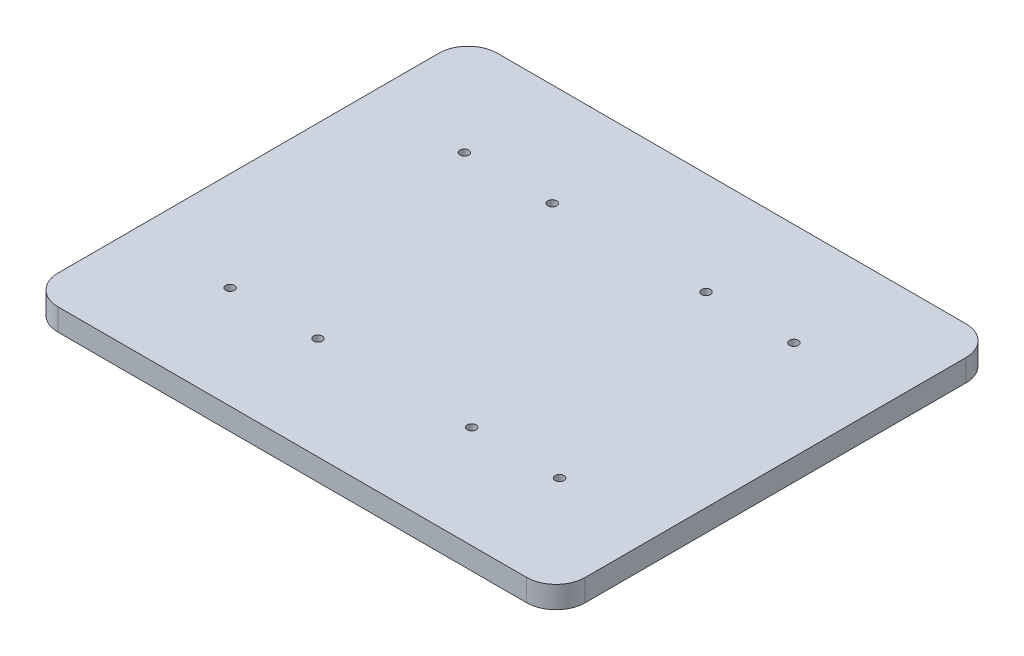
ISO-10303-21;
HEADER;
FILE_DESCRIPTION(('STEP AP214'),'2;1');
FILE_NAME('part.step','',(''),(''),'','','');
FILE_SCHEMA(('AUTOMOTIVE_DESIGN { 1 0 10303 214 1 1 1 1 }'));
ENDSEC;
DATA;
#1=APPLICATION_CONTEXT('core data for automotive mechanical design processes');
#2=APPLICATION_PROTOCOL_DEFINITION('international standard','automotive_design',2000,#1);
#3=PRODUCT_CONTEXT('',#1,'mechanical');
#4=PRODUCT('Part','Part','',(#3));
#5=PRODUCT_RELATED_PRODUCT_CATEGORY('part','',(#4));
#6=PRODUCT_DEFINITION_FORMATION('','',#4);
#7=PRODUCT_DEFINITION_CONTEXT('part definition',#1,'design');
#8=PRODUCT_DEFINITION('design','',#6,#7);
#9=PRODUCT_DEFINITION_SHAPE('','',#8);
#10=(LENGTH_UNIT() NAMED_UNIT(*) SI_UNIT(.MILLI.,.METRE.));
#11=(NAMED_UNIT(*) PLANE_ANGLE_UNIT() SI_UNIT($,.RADIAN.));
#12=(NAMED_UNIT(*) SI_UNIT($,.STERADIAN.) SOLID_ANGLE_UNIT());
#13=UNCERTAINTY_MEASURE_WITH_UNIT(LENGTH_MEASURE(1.E-05),#10,'distance_accuracy_value','');
#14=(GEOMETRIC_REPRESENTATION_CONTEXT(3) GLOBAL_UNCERTAINTY_ASSIGNED_CONTEXT((#13)) GLOBAL_UNIT_ASSIGNED_CONTEXT((#10,
#11,#12)) REPRESENTATION_CONTEXT('',''));
#15=CARTESIAN_POINT('',(0.,0.,0.));
#16=DIRECTION('',(0.,0.,1.));
#17=DIRECTION('',(1.,0.,0.));
#18=AXIS2_PLACEMENT_3D('',#15,#16,#17);
#19=CARTESIAN_POINT('',(0.,15.,0.));
#20=DIRECTION('',(0.,-1.,0.));
#21=DIRECTION('',(0.,0.,-1.));
#22=AXIS2_PLACEMENT_3D('',#19,#20,#21);
#23=PLANE('',#22);
#24=CARTESIAN_POINT('',(112.5,15.,80.));
#25=DIRECTION('',(0.,1.,0.));
#26=DIRECTION('',(0.,0.,1.));
#27=AXIS2_PLACEMENT_3D('',#24,#25,#26);
#28=CIRCLE('',#27,3.);
#29=CARTESIAN_POINT('',(112.5,15.,83.));
#30=VERTEX_POINT('',#29);
#31=EDGE_CURVE('E208',#30,#30,#28,.T.);
#32=ORIENTED_EDGE('',*,*,#31,.F.);
#33=EDGE_LOOP('',(#32));
#34=FACE_BOUND('',#33,.T.);
#35=CARTESIAN_POINT('',(112.5,15.,-80.));
#36=DIRECTION('',(0.,1.,0.));
#37=DIRECTION('',(0.,0.,1.));
#38=AXIS2_PLACEMENT_3D('',#35,#36,#37);
#39=CIRCLE('',#38,3.);
#40=CARTESIAN_POINT('',(112.5,15.,-77.));
#41=VERTEX_POINT('',#40);
#42=EDGE_CURVE('E202',#41,#41,#39,.T.);
#43=ORIENTED_EDGE('',*,*,#42,.F.);
#44=EDGE_LOOP('',(#43));
#45=FACE_BOUND('',#44,.T.);
#46=CARTESIAN_POINT('',(52.5,15.,-80.));
#47=DIRECTION('',(0.,1.,0.));
#48=DIRECTION('',(0.,0.,1.));
#49=AXIS2_PLACEMENT_3D('',#46,#47,#48);
#50=CIRCLE('',#49,3.);
#51=CARTESIAN_POINT('',(52.5,15.,-77.));
#52=VERTEX_POINT('',#51);
#53=EDGE_CURVE('E196',#52,#52,#50,.T.);
#54=ORIENTED_EDGE('',*,*,#53,.F.);
#55=EDGE_LOOP('',(#54));
#56=FACE_BOUND('',#55,.T.);
#57=CARTESIAN_POINT('',(-52.5,15.,-80.));
#58=DIRECTION('',(0.,1.,0.));
#59=DIRECTION('',(0.,0.,1.));
#60=AXIS2_PLACEMENT_3D('',#57,#58,#59);
#61=CIRCLE('',#60,3.);
#62=CARTESIAN_POINT('',(-52.5,15.,-77.));
#63=VERTEX_POINT('',#62);
#64=EDGE_CURVE('E190',#63,#63,#61,.T.);
#65=ORIENTED_EDGE('',*,*,#64,.F.);
#66=EDGE_LOOP('',(#65));
#67=FACE_BOUND('',#66,.T.);
#68=DIRECTION('',(-1.,0.,0.));
#69=VECTOR('',#68,1.);
#70=CARTESIAN_POINT('',(-180.,15.,-150.));
#71=LINE('',#70,#69);
#72=CARTESIAN_POINT('',(160.,15.,-150.));
#73=VERTEX_POINT('',#72);
#74=CARTESIAN_POINT('',(-160.,15.,-150.));
#75=VERTEX_POINT('',#74);
#76=EDGE_CURVE('E171',#73,#75,#71,.T.);
#77=ORIENTED_EDGE('',*,*,#76,.T.);
#78=CARTESIAN_POINT('',(-160.,15.,-130.));
#79=DIRECTION('',(0.,-1.,0.));
#80=DIRECTION('',(0.,0.,-1.));
#81=AXIS2_PLACEMENT_3D('',#78,#79,#80);
#82=CIRCLE('',#81,20.);
#83=CARTESIAN_POINT('',(-180.,15.,-130.));
#84=VERTEX_POINT('',#83);
#85=EDGE_CURVE('E151',#75,#84,#82,.F.);
#86=ORIENTED_EDGE('',*,*,#85,.T.);
#87=DIRECTION('',(0.,0.,1.));
#88=VECTOR('',#87,1.);
#89=CARTESIAN_POINT('',(-180.,15.,150.));
#90=LINE('',#89,#88);
#91=CARTESIAN_POINT('',(-180.,15.,130.));
#92=VERTEX_POINT('',#91);
#93=EDGE_CURVE('E122',#84,#92,#90,.T.);
#94=ORIENTED_EDGE('',*,*,#93,.T.);
#95=CARTESIAN_POINT('',(-160.,15.,130.));
#96=DIRECTION('',(0.,-1.,0.));
#97=DIRECTION('',(0.,0.,-1.));
#98=AXIS2_PLACEMENT_3D('',#95,#96,#97);
#99=CIRCLE('',#98,20.);
#100=CARTESIAN_POINT('',(-160.,15.,150.));
#101=VERTEX_POINT('',#100);
#102=EDGE_CURVE('E58',#92,#101,#99,.F.);
#103=ORIENTED_EDGE('',*,*,#102,.T.);
#104=DIRECTION('',(1.,0.,0.));
#105=VECTOR('',#104,1.);
#106=CARTESIAN_POINT('',(-180.,15.,150.));
#107=LINE('',#106,#105);
#108=CARTESIAN_POINT('',(160.,15.,150.));
#109=VERTEX_POINT('',#108);
#110=EDGE_CURVE('E138',#101,#109,#107,.T.);
#111=ORIENTED_EDGE('',*,*,#110,.T.);
#112=CARTESIAN_POINT('',(160.,15.,130.));
#113=DIRECTION('',(0.,-1.,0.));
#114=DIRECTION('',(0.,0.,-1.));
#115=AXIS2_PLACEMENT_3D('',#112,#113,#114);
#116=CIRCLE('',#115,20.);
#117=CARTESIAN_POINT('',(180.,15.,130.));
#118=VERTEX_POINT('',#117);
#119=EDGE_CURVE('E146',#109,#118,#116,.F.);
#120=ORIENTED_EDGE('',*,*,#119,.T.);
#121=DIRECTION('',(0.,0.,-1.));
#122=VECTOR('',#121,1.);
#123=CARTESIAN_POINT('',(180.,15.,150.));
#124=LINE('',#123,#122);
#125=CARTESIAN_POINT('',(180.,15.,-130.));
#126=VERTEX_POINT('',#125);
#127=EDGE_CURVE('E132',#118,#126,#124,.T.);
#128=ORIENTED_EDGE('',*,*,#127,.T.);
#129=CARTESIAN_POINT('',(160.,15.,-130.));
#130=DIRECTION('',(0.,-1.,0.));
#131=DIRECTION('',(0.,0.,-1.));
#132=AXIS2_PLACEMENT_3D('',#129,#130,#131);
#133=CIRCLE('',#132,20.);
#134=EDGE_CURVE('E149',#126,#73,#133,.F.);
#135=ORIENTED_EDGE('',*,*,#134,.T.);
#136=EDGE_LOOP('',(#77,#86,#94,#103,#111,#120,#128,#135));
#137=FACE_BOUND('',#136,.T.);
#138=CARTESIAN_POINT('',(-112.5,15.,-80.));
#139=DIRECTION('',(0.,1.,0.));
#140=DIRECTION('',(0.,0.,1.));
#141=AXIS2_PLACEMENT_3D('',#138,#139,#140);
#142=CIRCLE('',#141,3.);
#143=CARTESIAN_POINT('',(-112.5,15.,-77.));
#144=VERTEX_POINT('',#143);
#145=EDGE_CURVE('E179',#144,#144,#142,.T.);
#146=ORIENTED_EDGE('',*,*,#145,.F.);
#147=EDGE_LOOP('',(#146));
#148=FACE_BOUND('',#147,.T.);
#149=CARTESIAN_POINT('',(52.5,15.,80.));
#150=DIRECTION('',(0.,1.,0.));
#151=DIRECTION('',(0.,0.,1.));
#152=AXIS2_PLACEMENT_3D('',#149,#150,#151);
#153=CIRCLE('',#152,3.);
#154=CARTESIAN_POINT('',(52.5,15.,83.));
#155=VERTEX_POINT('',#154);
#156=EDGE_CURVE('E214',#155,#155,#153,.T.);
#157=ORIENTED_EDGE('',*,*,#156,.F.);
#158=EDGE_LOOP('',(#157));
#159=FACE_BOUND('',#158,.T.);
#160=CARTESIAN_POINT('',(-52.5,15.,80.));
#161=DIRECTION('',(0.,1.,0.));
#162=DIRECTION('',(0.,0.,1.));
#163=AXIS2_PLACEMENT_3D('',#160,#161,#162);
#164=CIRCLE('',#163,3.);
#165=CARTESIAN_POINT('',(-52.5,15.,83.));
#166=VERTEX_POINT('',#165);
#167=EDGE_CURVE('E220',#166,#166,#164,.T.);
#168=ORIENTED_EDGE('',*,*,#167,.F.);
#169=EDGE_LOOP('',(#168));
#170=FACE_BOUND('',#169,.T.);
#171=CARTESIAN_POINT('',(-112.5,15.,80.));
#172=DIRECTION('',(0.,1.,0.));
#173=DIRECTION('',(0.,0.,1.));
#174=AXIS2_PLACEMENT_3D('',#171,#172,#173);
#175=CIRCLE('',#174,3.);
#176=CARTESIAN_POINT('',(-112.5,15.,83.));
#177=VERTEX_POINT('',#176);
#178=EDGE_CURVE('E226',#177,#177,#175,.T.);
#179=ORIENTED_EDGE('',*,*,#178,.F.);
#180=EDGE_LOOP('',(#179));
#181=FACE_BOUND('',#180,.T.);
#182=ADVANCED_FACE('F37',(#34,#45,#56,#67,#137,#148,#159,#170,#181),#23,.F.);
#183=CARTESIAN_POINT('',(180.,15.,150.));
#184=DIRECTION('',(-1.,0.,0.));
#185=DIRECTION('',(0.,0.,1.));
#186=AXIS2_PLACEMENT_3D('',#183,#184,#185);
#187=PLANE('',#186);
#188=DIRECTION('',(0.,0.,-1.));
#189=VECTOR('',#188,1.);
#190=CARTESIAN_POINT('',(180.,0.,150.));
#191=LINE('',#190,#189);
#192=CARTESIAN_POINT('',(180.,0.,130.));
#193=VERTEX_POINT('',#192);
#194=CARTESIAN_POINT('',(180.,0.,-130.));
#195=VERTEX_POINT('',#194);
#196=EDGE_CURVE('E134',#193,#195,#191,.T.);
#197=ORIENTED_EDGE('',*,*,#196,.T.);
#198=DIRECTION('',(0.,-1.,0.));
#199=VECTOR('',#198,1.);
#200=CARTESIAN_POINT('',(180.,15.,-130.));
#201=LINE('',#200,#199);
#202=EDGE_CURVE('E156',#195,#126,#201,.F.);
#203=ORIENTED_EDGE('',*,*,#202,.T.);
#204=ORIENTED_EDGE('',*,*,#127,.F.);
#205=DIRECTION('',(0.,-1.,0.));
#206=VECTOR('',#205,1.);
#207=CARTESIAN_POINT('',(180.,15.,130.));
#208=LINE('',#207,#206);
#209=EDGE_CURVE('E153',#118,#193,#208,.T.);
#210=ORIENTED_EDGE('',*,*,#209,.T.);
#211=EDGE_LOOP('',(#197,#203,#204,#210));
#212=FACE_BOUND('',#211,.T.);
#213=ADVANCED_FACE('F162',(#212),#187,.F.);
#214=CARTESIAN_POINT('',(-180.,15.,-150.));
#215=DIRECTION('',(0.,0.,1.));
#216=DIRECTION('',(1.,0.,0.));
#217=AXIS2_PLACEMENT_3D('',#214,#215,#216);
#218=PLANE('',#217);
#219=DIRECTION('',(-1.,0.,0.));
#220=VECTOR('',#219,1.);
#221=CARTESIAN_POINT('',(-180.,0.,-150.));
#222=LINE('',#221,#220);
#223=CARTESIAN_POINT('',(160.,0.,-150.));
#224=VERTEX_POINT('',#223);
#225=CARTESIAN_POINT('',(-160.,0.,-150.));
#226=VERTEX_POINT('',#225);
#227=EDGE_CURVE('E130',#224,#226,#222,.T.);
#228=ORIENTED_EDGE('',*,*,#227,.T.);
#229=DIRECTION('',(0.,-1.,0.));
#230=VECTOR('',#229,1.);
#231=CARTESIAN_POINT('',(-160.,15.,-150.));
#232=LINE('',#231,#230);
#233=EDGE_CURVE('E108',#226,#75,#232,.F.);
#234=ORIENTED_EDGE('',*,*,#233,.T.);
#235=ORIENTED_EDGE('',*,*,#76,.F.);
#236=DIRECTION('',(0.,-1.,0.));
#237=VECTOR('',#236,1.);
#238=CARTESIAN_POINT('',(160.,15.,-150.));
#239=LINE('',#238,#237);
#240=EDGE_CURVE('E113',#73,#224,#239,.T.);
#241=ORIENTED_EDGE('',*,*,#240,.T.);
#242=EDGE_LOOP('',(#228,#234,#235,#241));
#243=FACE_BOUND('',#242,.T.);
#244=ADVANCED_FACE('F176',(#243),#218,.F.);
#245=CARTESIAN_POINT('',(-180.,15.,150.));
#246=DIRECTION('',(1.,0.,0.));
#247=DIRECTION('',(0.,0.,-1.));
#248=AXIS2_PLACEMENT_3D('',#245,#246,#247);
#249=PLANE('',#248);
#250=ORIENTED_EDGE('',*,*,#93,.F.);
#251=DIRECTION('',(0.,-1.,0.));
#252=VECTOR('',#251,1.);
#253=CARTESIAN_POINT('',(-180.,15.,-130.));
#254=LINE('',#253,#252);
#255=CARTESIAN_POINT('',(-180.,0.,-130.));
#256=VERTEX_POINT('',#255);
#257=EDGE_CURVE('E107',#84,#256,#254,.T.);
#258=ORIENTED_EDGE('',*,*,#257,.T.);
#259=DIRECTION('',(0.,0.,1.));
#260=VECTOR('',#259,1.);
#261=CARTESIAN_POINT('',(-180.,0.,150.));
#262=LINE('',#261,#260);
#263=CARTESIAN_POINT('',(-180.,0.,130.));
#264=VERTEX_POINT('',#263);
#265=EDGE_CURVE('E120',#256,#264,#262,.T.);
#266=ORIENTED_EDGE('',*,*,#265,.T.);
#267=DIRECTION('',(0.,-1.,0.));
#268=VECTOR('',#267,1.);
#269=CARTESIAN_POINT('',(-180.,15.,130.));
#270=LINE('',#269,#268);
#271=EDGE_CURVE('E124',#264,#92,#270,.F.);
#272=ORIENTED_EDGE('',*,*,#271,.T.);
#273=EDGE_LOOP('',(#250,#258,#266,#272));
#274=FACE_BOUND('',#273,.T.);
#275=ADVANCED_FACE('F119',(#274),#249,.F.);
#276=CARTESIAN_POINT('',(-180.,15.,150.));
#277=DIRECTION('',(0.,0.,-1.));
#278=DIRECTION('',(-1.,0.,0.));
#279=AXIS2_PLACEMENT_3D('',#276,#277,#278);
#280=PLANE('',#279);
#281=ORIENTED_EDGE('',*,*,#110,.F.);
#282=DIRECTION('',(0.,-1.,0.));
#283=VECTOR('',#282,1.);
#284=CARTESIAN_POINT('',(-160.,15.,150.));
#285=LINE('',#284,#283);
#286=CARTESIAN_POINT('',(-160.,0.,150.));
#287=VERTEX_POINT('',#286);
#288=EDGE_CURVE('E11',#101,#287,#285,.T.);
#289=ORIENTED_EDGE('',*,*,#288,.T.);
#290=DIRECTION('',(1.,0.,0.));
#291=VECTOR('',#290,1.);
#292=CARTESIAN_POINT('',(-180.,0.,150.));
#293=LINE('',#292,#291);
#294=CARTESIAN_POINT('',(160.,0.,150.));
#295=VERTEX_POINT('',#294);
#296=EDGE_CURVE('E129',#287,#295,#293,.T.);
#297=ORIENTED_EDGE('',*,*,#296,.T.);
#298=DIRECTION('',(0.,-1.,0.));
#299=VECTOR('',#298,1.);
#300=CARTESIAN_POINT('',(160.,15.,150.));
#301=LINE('',#300,#299);
#302=EDGE_CURVE('E45',#295,#109,#301,.F.);
#303=ORIENTED_EDGE('',*,*,#302,.T.);
#304=EDGE_LOOP('',(#281,#289,#297,#303));
#305=FACE_BOUND('',#304,.T.);
#306=ADVANCED_FACE('F248',(#305),#280,.F.);
#307=CARTESIAN_POINT('',(0.,0.,0.));
#308=DIRECTION('',(0.,-1.,0.));
#309=DIRECTION('',(0.,0.,-1.));
#310=AXIS2_PLACEMENT_3D('',#307,#308,#309);
#311=PLANE('',#310);
#312=CARTESIAN_POINT('',(-112.5,0.,80.));
#313=DIRECTION('',(0.,-1.,0.));
#314=DIRECTION('',(0.,0.,-1.));
#315=AXIS2_PLACEMENT_3D('',#312,#313,#314);
#316=CIRCLE('',#315,3.);
#317=CARTESIAN_POINT('',(-112.5,0.,77.));
#318=VERTEX_POINT('',#317);
#319=EDGE_CURVE('E223',#318,#318,#316,.T.);
#320=ORIENTED_EDGE('',*,*,#319,.F.);
#321=EDGE_LOOP('',(#320));
#322=FACE_BOUND('',#321,.T.);
#323=CARTESIAN_POINT('',(-52.5,0.,80.));
#324=DIRECTION('',(0.,-1.,0.));
#325=DIRECTION('',(0.,0.,-1.));
#326=AXIS2_PLACEMENT_3D('',#323,#324,#325);
#327=CIRCLE('',#326,3.);
#328=CARTESIAN_POINT('',(-52.5,0.,77.));
#329=VERTEX_POINT('',#328);
#330=EDGE_CURVE('E217',#329,#329,#327,.T.);
#331=ORIENTED_EDGE('',*,*,#330,.F.);
#332=EDGE_LOOP('',(#331));
#333=FACE_BOUND('',#332,.T.);
#334=CARTESIAN_POINT('',(52.5,0.,80.));
#335=DIRECTION('',(0.,-1.,0.));
#336=DIRECTION('',(0.,0.,-1.));
#337=AXIS2_PLACEMENT_3D('',#334,#335,#336);
#338=CIRCLE('',#337,3.);
#339=CARTESIAN_POINT('',(52.5,0.,77.));
#340=VERTEX_POINT('',#339);
#341=EDGE_CURVE('E211',#340,#340,#338,.T.);
#342=ORIENTED_EDGE('',*,*,#341,.F.);
#343=EDGE_LOOP('',(#342));
#344=FACE_BOUND('',#343,.T.);
#345=CARTESIAN_POINT('',(112.5,0.,80.));
#346=DIRECTION('',(0.,-1.,0.));
#347=DIRECTION('',(0.,0.,-1.));
#348=AXIS2_PLACEMENT_3D('',#345,#346,#347);
#349=CIRCLE('',#348,3.);
#350=CARTESIAN_POINT('',(112.5,0.,77.));
#351=VERTEX_POINT('',#350);
#352=EDGE_CURVE('E205',#351,#351,#349,.T.);
#353=ORIENTED_EDGE('',*,*,#352,.F.);
#354=EDGE_LOOP('',(#353));
#355=FACE_BOUND('',#354,.T.);
#356=CARTESIAN_POINT('',(112.5,0.,-80.));
#357=DIRECTION('',(0.,-1.,0.));
#358=DIRECTION('',(0.,0.,-1.));
#359=AXIS2_PLACEMENT_3D('',#356,#357,#358);
#360=CIRCLE('',#359,3.);
#361=CARTESIAN_POINT('',(112.5,0.,-83.));
#362=VERTEX_POINT('',#361);
#363=EDGE_CURVE('E199',#362,#362,#360,.T.);
#364=ORIENTED_EDGE('',*,*,#363,.F.);
#365=EDGE_LOOP('',(#364));
#366=FACE_BOUND('',#365,.T.);
#367=CARTESIAN_POINT('',(52.5,0.,-80.));
#368=DIRECTION('',(0.,-1.,0.));
#369=DIRECTION('',(0.,0.,-1.));
#370=AXIS2_PLACEMENT_3D('',#367,#368,#369);
#371=CIRCLE('',#370,3.);
#372=CARTESIAN_POINT('',(52.5,0.,-83.));
#373=VERTEX_POINT('',#372);
#374=EDGE_CURVE('E193',#373,#373,#371,.T.);
#375=ORIENTED_EDGE('',*,*,#374,.F.);
#376=EDGE_LOOP('',(#375));
#377=FACE_BOUND('',#376,.T.);
#378=CARTESIAN_POINT('',(-52.5,0.,-80.));
#379=DIRECTION('',(0.,-1.,0.));
#380=DIRECTION('',(0.,0.,-1.));
#381=AXIS2_PLACEMENT_3D('',#378,#379,#380);
#382=CIRCLE('',#381,3.);
#383=CARTESIAN_POINT('',(-52.5,0.,-83.));
#384=VERTEX_POINT('',#383);
#385=EDGE_CURVE('E187',#384,#384,#382,.T.);
#386=ORIENTED_EDGE('',*,*,#385,.F.);
#387=EDGE_LOOP('',(#386));
#388=FACE_BOUND('',#387,.T.);
#389=CARTESIAN_POINT('',(-112.5,0.,-80.));
#390=DIRECTION('',(0.,-1.,0.));
#391=DIRECTION('',(0.,0.,-1.));
#392=AXIS2_PLACEMENT_3D('',#389,#390,#391);
#393=CIRCLE('',#392,3.);
#394=CARTESIAN_POINT('',(-112.5,0.,-83.));
#395=VERTEX_POINT('',#394);
#396=EDGE_CURVE('E177',#395,#395,#393,.T.);
#397=ORIENTED_EDGE('',*,*,#396,.F.);
#398=EDGE_LOOP('',(#397));
#399=FACE_BOUND('',#398,.T.);
#400=ORIENTED_EDGE('',*,*,#265,.F.);
#401=CARTESIAN_POINT('',(-160.,0.,-130.));
#402=DIRECTION('',(0.,-1.,0.));
#403=DIRECTION('',(0.,0.,-1.));
#404=AXIS2_PLACEMENT_3D('',#401,#402,#403);
#405=CIRCLE('',#404,20.);
#406=EDGE_CURVE('E103',#256,#226,#405,.T.);
#407=ORIENTED_EDGE('',*,*,#406,.T.);
#408=ORIENTED_EDGE('',*,*,#227,.F.);
#409=CARTESIAN_POINT('',(160.,0.,-130.));
#410=DIRECTION('',(0.,-1.,0.));
#411=DIRECTION('',(0.,0.,-1.));
#412=AXIS2_PLACEMENT_3D('',#409,#410,#411);
#413=CIRCLE('',#412,20.);
#414=EDGE_CURVE('E114',#224,#195,#413,.T.);
#415=ORIENTED_EDGE('',*,*,#414,.T.);
#416=ORIENTED_EDGE('',*,*,#196,.F.);
#417=CARTESIAN_POINT('',(160.,0.,130.));
#418=DIRECTION('',(0.,-1.,0.));
#419=DIRECTION('',(0.,0.,-1.));
#420=AXIS2_PLACEMENT_3D('',#417,#418,#419);
#421=CIRCLE('',#420,20.);
#422=EDGE_CURVE('E123',#193,#295,#421,.T.);
#423=ORIENTED_EDGE('',*,*,#422,.T.);
#424=ORIENTED_EDGE('',*,*,#296,.F.);
#425=CARTESIAN_POINT('',(-160.,0.,130.));
#426=DIRECTION('',(0.,-1.,0.));
#427=DIRECTION('',(0.,0.,-1.));
#428=AXIS2_PLACEMENT_3D('',#425,#426,#427);
#429=CIRCLE('',#428,20.);
#430=EDGE_CURVE('E128',#287,#264,#429,.T.);
#431=ORIENTED_EDGE('',*,*,#430,.T.);
#432=EDGE_LOOP('',(#400,#407,#408,#415,#416,#423,#424,#431));
#433=FACE_BOUND('',#432,.T.);
#434=ADVANCED_FACE('F126',(#322,#333,#344,#355,#366,#377,#388,#399,#433),#311,.T.);
#435=CARTESIAN_POINT('',(-160.,15.,-130.));
#436=DIRECTION('',(0.,-1.,0.));
#437=DIRECTION('',(0.,0.,-1.));
#438=AXIS2_PLACEMENT_3D('',#435,#436,#437);
#439=CYLINDRICAL_SURFACE('',#438,20.);
#440=ORIENTED_EDGE('',*,*,#85,.F.);
#441=ORIENTED_EDGE('',*,*,#233,.F.);
#442=ORIENTED_EDGE('',*,*,#406,.F.);
#443=ORIENTED_EDGE('',*,*,#257,.F.);
#444=EDGE_LOOP('',(#440,#441,#442,#443));
#445=FACE_BOUND('',#444,.T.);
#446=ADVANCED_FACE('F106',(#445),#439,.T.);
#447=CARTESIAN_POINT('',(160.,15.,-130.));
#448=DIRECTION('',(0.,-1.,0.));
#449=DIRECTION('',(0.,0.,-1.));
#450=AXIS2_PLACEMENT_3D('',#447,#448,#449);
#451=CYLINDRICAL_SURFACE('',#450,20.);
#452=ORIENTED_EDGE('',*,*,#134,.F.);
#453=ORIENTED_EDGE('',*,*,#202,.F.);
#454=ORIENTED_EDGE('',*,*,#414,.F.);
#455=ORIENTED_EDGE('',*,*,#240,.F.);
#456=EDGE_LOOP('',(#452,#453,#454,#455));
#457=FACE_BOUND('',#456,.T.);
#458=ADVANCED_FACE('F174',(#457),#451,.T.);
#459=CARTESIAN_POINT('',(-160.,15.,130.));
#460=DIRECTION('',(0.,-1.,0.));
#461=DIRECTION('',(0.,0.,-1.));
#462=AXIS2_PLACEMENT_3D('',#459,#460,#461);
#463=CYLINDRICAL_SURFACE('',#462,20.);
#464=ORIENTED_EDGE('',*,*,#102,.F.);
#465=ORIENTED_EDGE('',*,*,#271,.F.);
#466=ORIENTED_EDGE('',*,*,#430,.F.);
#467=ORIENTED_EDGE('',*,*,#288,.F.);
#468=EDGE_LOOP('',(#464,#465,#466,#467));
#469=FACE_BOUND('',#468,.T.);
#470=ADVANCED_FACE('F259',(#469),#463,.T.);
#471=CARTESIAN_POINT('',(160.,15.,130.));
#472=DIRECTION('',(0.,-1.,0.));
#473=DIRECTION('',(0.,0.,-1.));
#474=AXIS2_PLACEMENT_3D('',#471,#472,#473);
#475=CYLINDRICAL_SURFACE('',#474,20.);
#476=ORIENTED_EDGE('',*,*,#119,.F.);
#477=ORIENTED_EDGE('',*,*,#302,.F.);
#478=ORIENTED_EDGE('',*,*,#422,.F.);
#479=ORIENTED_EDGE('',*,*,#209,.F.);
#480=EDGE_LOOP('',(#476,#477,#478,#479));
#481=FACE_BOUND('',#480,.T.);
#482=ADVANCED_FACE('F39',(#481),#475,.T.);
#483=CARTESIAN_POINT('',(-112.5,15.,-80.));
#484=DIRECTION('',(0.,1.,0.));
#485=DIRECTION('',(0.,0.,1.));
#486=AXIS2_PLACEMENT_3D('',#483,#484,#485);
#487=CYLINDRICAL_SURFACE('',#486,3.);
#488=ORIENTED_EDGE('',*,*,#145,.T.);
#489=EDGE_LOOP('',(#488));
#490=FACE_BOUND('',#489,.T.);
#491=ORIENTED_EDGE('',*,*,#396,.T.);
#492=EDGE_LOOP('',(#491));
#493=FACE_BOUND('',#492,.T.);
#494=ADVANCED_FACE('F244',(#490,#493),#487,.F.);
#495=CARTESIAN_POINT('',(-52.5,15.,-80.));
#496=DIRECTION('',(0.,1.,0.));
#497=DIRECTION('',(0.,0.,1.));
#498=AXIS2_PLACEMENT_3D('',#495,#496,#497);
#499=CYLINDRICAL_SURFACE('',#498,3.);
#500=ORIENTED_EDGE('',*,*,#64,.T.);
#501=EDGE_LOOP('',(#500));
#502=FACE_BOUND('',#501,.T.);
#503=ORIENTED_EDGE('',*,*,#385,.T.);
#504=EDGE_LOOP('',(#503));
#505=FACE_BOUND('',#504,.T.);
#506=ADVANCED_FACE('F270',(#502,#505),#499,.F.);
#507=CARTESIAN_POINT('',(52.5,15.,-80.));
#508=DIRECTION('',(0.,1.,0.));
#509=DIRECTION('',(0.,0.,1.));
#510=AXIS2_PLACEMENT_3D('',#507,#508,#509);
#511=CYLINDRICAL_SURFACE('',#510,3.);
#512=ORIENTED_EDGE('',*,*,#53,.T.);
#513=EDGE_LOOP('',(#512));
#514=FACE_BOUND('',#513,.T.);
#515=ORIENTED_EDGE('',*,*,#374,.T.);
#516=EDGE_LOOP('',(#515));
#517=FACE_BOUND('',#516,.T.);
#518=ADVANCED_FACE('F275',(#514,#517),#511,.F.);
#519=CARTESIAN_POINT('',(112.5,15.,-80.));
#520=DIRECTION('',(0.,1.,0.));
#521=DIRECTION('',(0.,0.,1.));
#522=AXIS2_PLACEMENT_3D('',#519,#520,#521);
#523=CYLINDRICAL_SURFACE('',#522,3.);
#524=ORIENTED_EDGE('',*,*,#42,.T.);
#525=EDGE_LOOP('',(#524));
#526=FACE_BOUND('',#525,.T.);
#527=ORIENTED_EDGE('',*,*,#363,.T.);
#528=EDGE_LOOP('',(#527));
#529=FACE_BOUND('',#528,.T.);
#530=ADVANCED_FACE('F306',(#526,#529),#523,.F.);
#531=CARTESIAN_POINT('',(112.5,15.,80.));
#532=DIRECTION('',(0.,1.,0.));
#533=DIRECTION('',(0.,0.,1.));
#534=AXIS2_PLACEMENT_3D('',#531,#532,#533);
#535=CYLINDRICAL_SURFACE('',#534,3.);
#536=ORIENTED_EDGE('',*,*,#31,.T.);
#537=EDGE_LOOP('',(#536));
#538=FACE_BOUND('',#537,.T.);
#539=ORIENTED_EDGE('',*,*,#352,.T.);
#540=EDGE_LOOP('',(#539));
#541=FACE_BOUND('',#540,.T.);
#542=ADVANCED_FACE('F312',(#538,#541),#535,.F.);
#543=CARTESIAN_POINT('',(52.5,15.,80.));
#544=DIRECTION('',(0.,1.,0.));
#545=DIRECTION('',(0.,0.,1.));
#546=AXIS2_PLACEMENT_3D('',#543,#544,#545);
#547=CYLINDRICAL_SURFACE('',#546,3.);
#548=ORIENTED_EDGE('',*,*,#156,.T.);
#549=EDGE_LOOP('',(#548));
#550=FACE_BOUND('',#549,.T.);
#551=ORIENTED_EDGE('',*,*,#341,.T.);
#552=EDGE_LOOP('',(#551));
#553=FACE_BOUND('',#552,.T.);
#554=ADVANCED_FACE('F289',(#550,#553),#547,.F.);
#555=CARTESIAN_POINT('',(-52.5,15.,80.));
#556=DIRECTION('',(0.,1.,0.));
#557=DIRECTION('',(0.,0.,1.));
#558=AXIS2_PLACEMENT_3D('',#555,#556,#557);
#559=CYLINDRICAL_SURFACE('',#558,3.);
#560=ORIENTED_EDGE('',*,*,#167,.T.);
#561=EDGE_LOOP('',(#560));
#562=FACE_BOUND('',#561,.T.);
#563=ORIENTED_EDGE('',*,*,#330,.T.);
#564=EDGE_LOOP('',(#563));
#565=FACE_BOUND('',#564,.T.);
#566=ADVANCED_FACE('F286',(#562,#565),#559,.F.);
#567=CARTESIAN_POINT('',(-112.5,15.,80.));
#568=DIRECTION('',(0.,1.,0.));
#569=DIRECTION('',(0.,0.,1.));
#570=AXIS2_PLACEMENT_3D('',#567,#568,#569);
#571=CYLINDRICAL_SURFACE('',#570,3.);
#572=ORIENTED_EDGE('',*,*,#178,.T.);
#573=EDGE_LOOP('',(#572));
#574=FACE_BOUND('',#573,.T.);
#575=ORIENTED_EDGE('',*,*,#319,.T.);
#576=EDGE_LOOP('',(#575));
#577=FACE_BOUND('',#576,.T.);
#578=ADVANCED_FACE('F230',(#574,#577),#571,.F.);
#579=CLOSED_SHELL('',(#182,#213,#244,#275,#306,#434,#446,#458,#470,#482,#494,#506,#518,#530,
#542,#554,#566,#578));
#580=MANIFOLD_SOLID_BREP('B2',#579);
#581=ADVANCED_BREP_SHAPE_REPRESENTATION('',(#18,#580),#14);
#582=SHAPE_DEFINITION_REPRESENTATION(#9,#581);
ENDSEC;
END-ISO-10303-21;
